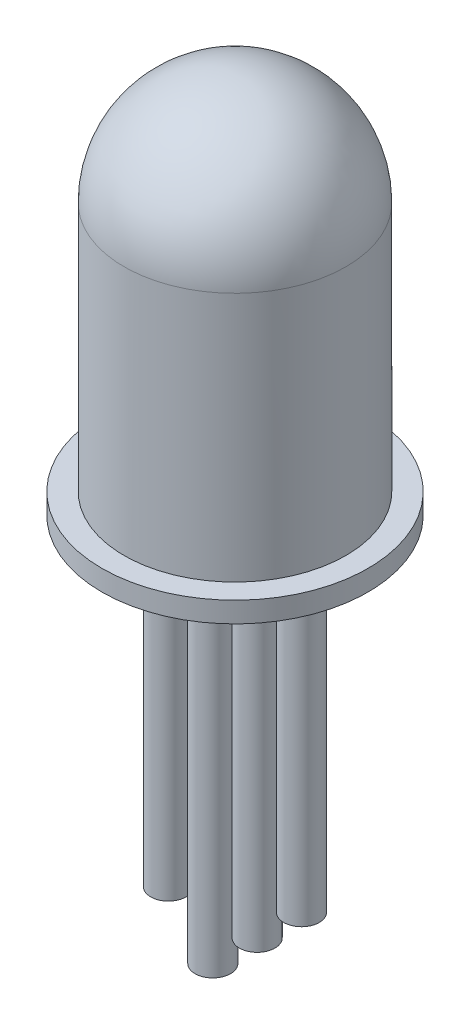
ISO-10303-21;
HEADER;
FILE_DESCRIPTION(('STEP AP214'),'2;1');
FILE_NAME('part.step','',(''),(''),'','','');
FILE_SCHEMA(('AUTOMOTIVE_DESIGN { 1 0 10303 214 1 1 1 1 }'));
ENDSEC;
DATA;
#1=APPLICATION_CONTEXT('core data for automotive mechanical design processes');
#2=APPLICATION_PROTOCOL_DEFINITION('international standard','automotive_design',2000,#1);
#3=PRODUCT_CONTEXT('',#1,'mechanical');
#4=PRODUCT('Part','Part','',(#3));
#5=PRODUCT_RELATED_PRODUCT_CATEGORY('part','',(#4));
#6=PRODUCT_DEFINITION_FORMATION('','',#4);
#7=PRODUCT_DEFINITION_CONTEXT('part definition',#1,'design');
#8=PRODUCT_DEFINITION('design','',#6,#7);
#9=PRODUCT_DEFINITION_SHAPE('','',#8);
#10=(LENGTH_UNIT() NAMED_UNIT(*) SI_UNIT(.MILLI.,.METRE.));
#11=(NAMED_UNIT(*) PLANE_ANGLE_UNIT() SI_UNIT($,.RADIAN.));
#12=(NAMED_UNIT(*) SI_UNIT($,.STERADIAN.) SOLID_ANGLE_UNIT());
#13=UNCERTAINTY_MEASURE_WITH_UNIT(LENGTH_MEASURE(1.E-05),#10,'distance_accuracy_value','');
#14=(GEOMETRIC_REPRESENTATION_CONTEXT(3) GLOBAL_UNCERTAINTY_ASSIGNED_CONTEXT((#13)) GLOBAL_UNIT_ASSIGNED_CONTEXT((#10,
#11,#12)) REPRESENTATION_CONTEXT('',''));
#15=CARTESIAN_POINT('',(0.,0.,0.));
#16=DIRECTION('',(0.,0.,1.));
#17=DIRECTION('',(1.,0.,0.));
#18=AXIS2_PLACEMENT_3D('',#15,#16,#17);
#19=CARTESIAN_POINT('',(0.,1.03389830508474,0.));
#20=DIRECTION('',(0.,-1.,0.));
#21=DIRECTION('',(0.,0.,-1.));
#22=AXIS2_PLACEMENT_3D('',#19,#20,#21);
#23=PLANE('',#22);
#24=CARTESIAN_POINT('',(1.5,1.03389830508474,0.));
#25=DIRECTION('',(0.,-1.,0.));
#26=DIRECTION('',(0.,0.,-1.));
#27=AXIS2_PLACEMENT_3D('',#24,#25,#26);
#28=CIRCLE('',#27,0.4);
#29=CARTESIAN_POINT('',(1.5,1.03389830508474,-0.4));
#30=VERTEX_POINT('',#29);
#31=EDGE_CURVE('E78',#30,#30,#28,.T.);
#32=ORIENTED_EDGE('',*,*,#31,.F.);
#33=EDGE_LOOP('',(#32));
#34=FACE_BOUND('',#33,.T.);
#35=CARTESIAN_POINT('',(0.5,1.03389830508474,0.));
#36=DIRECTION('',(0.,-1.,0.));
#37=DIRECTION('',(0.,0.,-1.));
#38=AXIS2_PLACEMENT_3D('',#35,#36,#37);
#39=CIRCLE('',#38,0.4);
#40=CARTESIAN_POINT('',(0.5,1.03389830508474,-0.4));
#41=VERTEX_POINT('',#40);
#42=EDGE_CURVE('E74',#41,#41,#39,.T.);
#43=ORIENTED_EDGE('',*,*,#42,.F.);
#44=EDGE_LOOP('',(#43));
#45=FACE_BOUND('',#44,.T.);
#46=CARTESIAN_POINT('',(-0.5,1.03389830508474,0.));
#47=DIRECTION('',(0.,-1.,0.));
#48=DIRECTION('',(0.,0.,-1.));
#49=AXIS2_PLACEMENT_3D('',#46,#47,#48);
#50=CIRCLE('',#49,0.4);
#51=CARTESIAN_POINT('',(-0.5,1.03389830508474,-0.4));
#52=VERTEX_POINT('',#51);
#53=EDGE_CURVE('E70',#52,#52,#50,.T.);
#54=ORIENTED_EDGE('',*,*,#53,.F.);
#55=EDGE_LOOP('',(#54));
#56=FACE_BOUND('',#55,.T.);
#57=CARTESIAN_POINT('',(-1.5,1.03389830508474,0.));
#58=DIRECTION('',(0.,-1.,0.));
#59=DIRECTION('',(0.,0.,-1.));
#60=AXIS2_PLACEMENT_3D('',#57,#58,#59);
#61=CIRCLE('',#60,0.4);
#62=CARTESIAN_POINT('',(-1.5,1.03389830508474,-0.4));
#63=VERTEX_POINT('',#62);
#64=EDGE_CURVE('E66',#63,#63,#61,.T.);
#65=ORIENTED_EDGE('',*,*,#64,.F.);
#66=EDGE_LOOP('',(#65));
#67=FACE_BOUND('',#66,.T.);
#68=CARTESIAN_POINT('',(0.,1.03389830508474,0.));
#69=DIRECTION('',(0.,-1.,0.));
#70=DIRECTION('',(0.,0.,-1.));
#71=AXIS2_PLACEMENT_3D('',#68,#69,#70);
#72=CIRCLE('',#71,3.);
#73=CARTESIAN_POINT('',(0.,1.03389830508474,-3.));
#74=VERTEX_POINT('',#73);
#75=EDGE_CURVE('E10',#74,#74,#72,.T.);
#76=ORIENTED_EDGE('',*,*,#75,.T.);
#77=EDGE_LOOP('',(#76));
#78=FACE_BOUND('',#77,.T.);
#79=ADVANCED_FACE('F43',(#34,#45,#56,#67,#78),#23,.T.);
#80=CARTESIAN_POINT('',(0.,1.03389830508474,0.));
#81=DIRECTION('',(0.,-1.,0.));
#82=DIRECTION('',(0.,0.,-1.));
#83=AXIS2_PLACEMENT_3D('',#80,#81,#82);
#84=CYLINDRICAL_SURFACE('',#83,3.);
#85=CARTESIAN_POINT('',(0.,1.49702201391308,0.));
#86=DIRECTION('',(0.,-1.,0.));
#87=DIRECTION('',(0.,0.,-1.));
#88=AXIS2_PLACEMENT_3D('',#85,#86,#87);
#89=CIRCLE('',#88,3.);
#90=CARTESIAN_POINT('',(0.,1.49702201391308,-3.));
#91=VERTEX_POINT('',#90);
#92=EDGE_CURVE('E50',#91,#91,#89,.T.);
#93=ORIENTED_EDGE('',*,*,#92,.T.);
#94=EDGE_LOOP('',(#93));
#95=FACE_BOUND('',#94,.T.);
#96=ORIENTED_EDGE('',*,*,#75,.F.);
#97=EDGE_LOOP('',(#96));
#98=FACE_BOUND('',#97,.T.);
#99=ADVANCED_FACE('F118',(#95,#98),#84,.T.);
#100=CARTESIAN_POINT('',(0.,1.49702201391308,0.));
#101=DIRECTION('',(0.,-1.,0.));
#102=DIRECTION('',(0.,0.,-1.));
#103=AXIS2_PLACEMENT_3D('',#100,#101,#102);
#104=PLANE('',#103);
#105=ORIENTED_EDGE('',*,*,#92,.F.);
#106=EDGE_LOOP('',(#105));
#107=FACE_BOUND('',#106,.T.);
#108=CARTESIAN_POINT('',(0.,1.49702201391308,0.));
#109=DIRECTION('',(0.,-1.,0.));
#110=DIRECTION('',(0.,0.,-1.));
#111=AXIS2_PLACEMENT_3D('',#108,#109,#110);
#112=CIRCLE('',#111,2.5);
#113=CARTESIAN_POINT('',(0.,1.49702201391308,-2.5));
#114=VERTEX_POINT('',#113);
#115=EDGE_CURVE('E55',#114,#114,#112,.T.);
#116=ORIENTED_EDGE('',*,*,#115,.T.);
#117=EDGE_LOOP('',(#116));
#118=FACE_BOUND('',#117,.T.);
#119=ADVANCED_FACE('F123',(#107,#118),#104,.F.);
#120=CARTESIAN_POINT('',(0.,1.03389830508474,0.));
#121=DIRECTION('',(0.,-1.,0.));
#122=DIRECTION('',(0.,0.,-1.));
#123=AXIS2_PLACEMENT_3D('',#120,#121,#122);
#124=CYLINDRICAL_SURFACE('',#123,2.5);
#125=ORIENTED_EDGE('',*,*,#115,.F.);
#126=EDGE_LOOP('',(#125));
#127=FACE_BOUND('',#126,.T.);
#128=CARTESIAN_POINT('',(0.,7.13389830508474,0.));
#129=DIRECTION('',(0.,-1.,0.));
#130=DIRECTION('',(0.,0.,-1.));
#131=AXIS2_PLACEMENT_3D('',#128,#129,#130);
#132=CIRCLE('',#131,2.5);
#133=CARTESIAN_POINT('',(0.,7.13389830508474,-2.5));
#134=VERTEX_POINT('',#133);
#135=EDGE_CURVE('E60',#134,#134,#132,.T.);
#136=ORIENTED_EDGE('',*,*,#135,.T.);
#137=EDGE_LOOP('',(#136));
#138=FACE_BOUND('',#137,.T.);
#139=ADVANCED_FACE('F220',(#127,#138),#124,.T.);
#140=CARTESIAN_POINT('',(0.,7.13389830508474,0.));
#141=DIRECTION('',(0.,-1.,0.));
#142=DIRECTION('',(1.,0.,0.));
#143=AXIS2_PLACEMENT_3D('',#140,#141,#142);
#144=SPHERICAL_SURFACE('',#143,2.5);
#145=ORIENTED_EDGE('',*,*,#135,.F.);
#146=EDGE_LOOP('',(#145));
#147=FACE_BOUND('',#146,.T.);
#148=ADVANCED_FACE('F114',(#147),#144,.T.);
#149=CARTESIAN_POINT('',(-1.5,-5.96610169491526,0.));
#150=DIRECTION('',(0.,1.,0.));
#151=DIRECTION('',(0.,0.,1.));
#152=AXIS2_PLACEMENT_3D('',#149,#150,#151);
#153=CYLINDRICAL_SURFACE('',#152,0.4);
#154=ORIENTED_EDGE('',*,*,#64,.T.);
#155=EDGE_LOOP('',(#154));
#156=FACE_BOUND('',#155,.T.);
#157=CARTESIAN_POINT('',(-1.5,-6.96610169491526,0.));
#158=DIRECTION('',(0.,-1.,0.));
#159=DIRECTION('',(0.,0.,-1.));
#160=AXIS2_PLACEMENT_3D('',#157,#158,#159);
#161=CIRCLE('',#160,0.4);
#162=CARTESIAN_POINT('',(-1.5,-6.96610169491526,-0.4));
#163=VERTEX_POINT('',#162);
#164=EDGE_CURVE('E90',#163,#163,#161,.T.);
#165=ORIENTED_EDGE('',*,*,#164,.F.);
#166=EDGE_LOOP('',(#165));
#167=FACE_BOUND('',#166,.T.);
#168=ADVANCED_FACE('F104',(#156,#167),#153,.T.);
#169=CARTESIAN_POINT('',(-0.5,-5.96610169491526,0.));
#170=DIRECTION('',(0.,1.,0.));
#171=DIRECTION('',(0.,0.,1.));
#172=AXIS2_PLACEMENT_3D('',#169,#170,#171);
#173=CYLINDRICAL_SURFACE('',#172,0.4);
#174=ORIENTED_EDGE('',*,*,#53,.T.);
#175=EDGE_LOOP('',(#174));
#176=FACE_BOUND('',#175,.T.);
#177=CARTESIAN_POINT('',(-0.5,-7.96610169491526,0.));
#178=DIRECTION('',(0.,-1.,0.));
#179=DIRECTION('',(0.,0.,-1.));
#180=AXIS2_PLACEMENT_3D('',#177,#178,#179);
#181=CIRCLE('',#180,0.4);
#182=CARTESIAN_POINT('',(-0.5,-7.96610169491526,-0.4));
#183=VERTEX_POINT('',#182);
#184=EDGE_CURVE('E94',#183,#183,#181,.T.);
#185=ORIENTED_EDGE('',*,*,#184,.F.);
#186=EDGE_LOOP('',(#185));
#187=FACE_BOUND('',#186,.T.);
#188=ADVANCED_FACE('F101',(#176,#187),#173,.T.);
#189=CARTESIAN_POINT('',(0.5,-5.96610169491526,0.));
#190=DIRECTION('',(0.,1.,0.));
#191=DIRECTION('',(0.,0.,1.));
#192=AXIS2_PLACEMENT_3D('',#189,#190,#191);
#193=CYLINDRICAL_SURFACE('',#192,0.4);
#194=ORIENTED_EDGE('',*,*,#42,.T.);
#195=EDGE_LOOP('',(#194));
#196=FACE_BOUND('',#195,.T.);
#197=CARTESIAN_POINT('',(0.5,-6.96610169491526,0.));
#198=DIRECTION('',(0.,-1.,0.));
#199=DIRECTION('',(0.,0.,-1.));
#200=AXIS2_PLACEMENT_3D('',#197,#198,#199);
#201=CIRCLE('',#200,0.4);
#202=CARTESIAN_POINT('',(0.5,-6.96610169491526,-0.4));
#203=VERTEX_POINT('',#202);
#204=EDGE_CURVE('E83',#203,#203,#201,.T.);
#205=ORIENTED_EDGE('',*,*,#204,.F.);
#206=EDGE_LOOP('',(#205));
#207=FACE_BOUND('',#206,.T.);
#208=ADVANCED_FACE('F103',(#196,#207),#193,.T.);
#209=CARTESIAN_POINT('',(1.5,-5.96610169491526,0.));
#210=DIRECTION('',(0.,1.,0.));
#211=DIRECTION('',(0.,0.,1.));
#212=AXIS2_PLACEMENT_3D('',#209,#210,#211);
#213=CYLINDRICAL_SURFACE('',#212,0.4);
#214=CARTESIAN_POINT('',(1.5,-5.96610169491526,0.));
#215=DIRECTION('',(0.,-1.,0.));
#216=DIRECTION('',(0.,0.,-1.));
#217=AXIS2_PLACEMENT_3D('',#214,#215,#216);
#218=CIRCLE('',#217,0.4);
#219=CARTESIAN_POINT('',(1.5,-5.96610169491526,-0.4));
#220=VERTEX_POINT('',#219);
#221=EDGE_CURVE('E79',#220,#220,#218,.T.);
#222=ORIENTED_EDGE('',*,*,#221,.F.);
#223=EDGE_LOOP('',(#222));
#224=FACE_BOUND('',#223,.T.);
#225=ORIENTED_EDGE('',*,*,#31,.T.);
#226=EDGE_LOOP('',(#225));
#227=FACE_BOUND('',#226,.T.);
#228=ADVANCED_FACE('F111',(#224,#227),#213,.T.);
#229=CARTESIAN_POINT('',(1.5,-5.96610169491526,0.));
#230=DIRECTION('',(0.,-1.,0.));
#231=DIRECTION('',(0.,0.,-1.));
#232=AXIS2_PLACEMENT_3D('',#229,#230,#231);
#233=PLANE('',#232);
#234=ORIENTED_EDGE('',*,*,#221,.T.);
#235=EDGE_LOOP('',(#234));
#236=FACE_BOUND('',#235,.T.);
#237=ADVANCED_FACE('F143',(#236),#233,.T.);
#238=CARTESIAN_POINT('',(0.5,-6.96610169491526,0.));
#239=DIRECTION('',(0.,-1.,0.));
#240=DIRECTION('',(0.,0.,-1.));
#241=AXIS2_PLACEMENT_3D('',#238,#239,#240);
#242=PLANE('',#241);
#243=ORIENTED_EDGE('',*,*,#204,.T.);
#244=EDGE_LOOP('',(#243));
#245=FACE_BOUND('',#244,.T.);
#246=ADVANCED_FACE('F136',(#245),#242,.T.);
#247=CARTESIAN_POINT('',(-1.5,-6.96610169491526,0.));
#248=DIRECTION('',(0.,-1.,0.));
#249=DIRECTION('',(0.,0.,-1.));
#250=AXIS2_PLACEMENT_3D('',#247,#248,#249);
#251=PLANE('',#250);
#252=ORIENTED_EDGE('',*,*,#164,.T.);
#253=EDGE_LOOP('',(#252));
#254=FACE_BOUND('',#253,.T.);
#255=ADVANCED_FACE('F134',(#254),#251,.T.);
#256=CARTESIAN_POINT('',(-0.5,-7.96610169491526,0.));
#257=DIRECTION('',(0.,-1.,0.));
#258=DIRECTION('',(0.,0.,-1.));
#259=AXIS2_PLACEMENT_3D('',#256,#257,#258);
#260=PLANE('',#259);
#261=ORIENTED_EDGE('',*,*,#184,.T.);
#262=EDGE_LOOP('',(#261));
#263=FACE_BOUND('',#262,.T.);
#264=ADVANCED_FACE('F99',(#263),#260,.T.);
#265=CLOSED_SHELL('',(#79,#99,#119,#139,#148,#168,#188,#208,#228,#237,#246,#255,#264));
#266=MANIFOLD_SOLID_BREP('B2',#265);
#267=ADVANCED_BREP_SHAPE_REPRESENTATION('',(#18,#266),#14);
#268=SHAPE_DEFINITION_REPRESENTATION(#9,#267);
ENDSEC;
END-ISO-10303-21;
